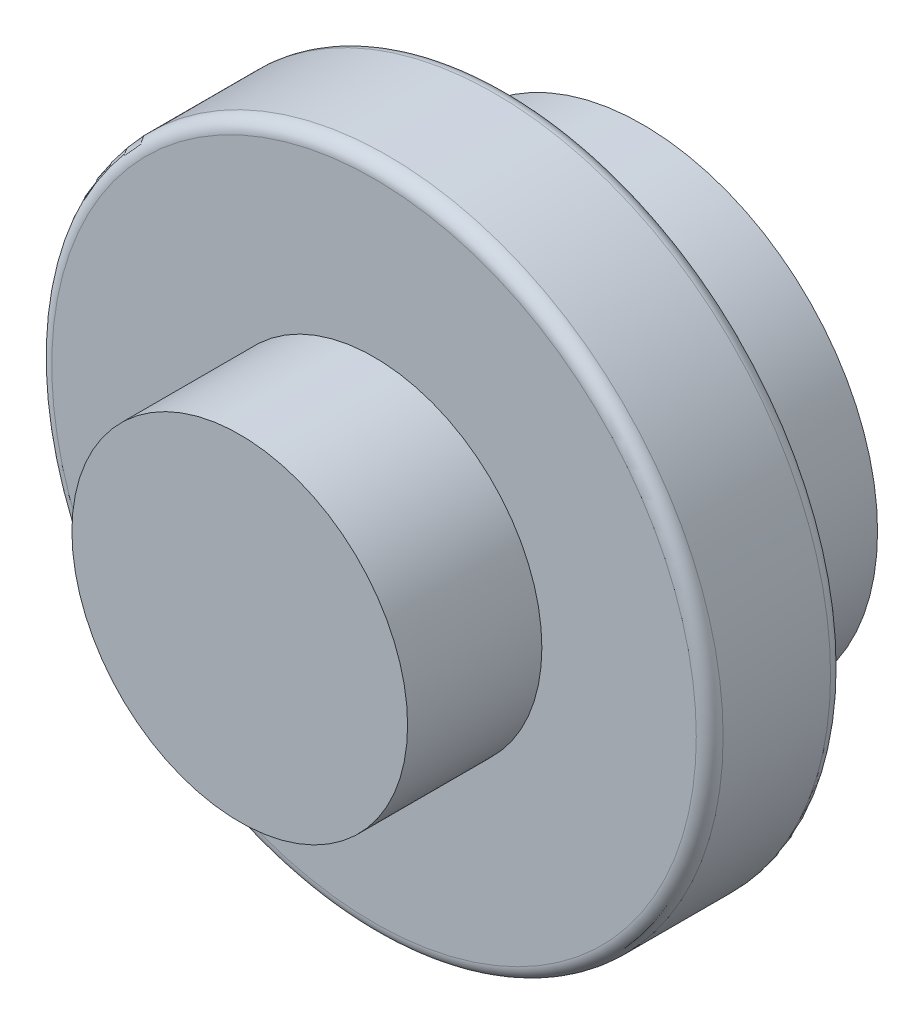
ISO-10303-21;
HEADER;
FILE_DESCRIPTION(('STEP AP214'),'2;1');
FILE_NAME('part.step','',(''),(''),'','','');
FILE_SCHEMA(('AUTOMOTIVE_DESIGN { 1 0 10303 214 1 1 1 1 }'));
ENDSEC;
DATA;
#1=APPLICATION_CONTEXT('core data for automotive mechanical design processes');
#2=APPLICATION_PROTOCOL_DEFINITION('international standard','automotive_design',2000,#1);
#3=PRODUCT_CONTEXT('',#1,'mechanical');
#4=PRODUCT('Part','Part','',(#3));
#5=PRODUCT_RELATED_PRODUCT_CATEGORY('part','',(#4));
#6=PRODUCT_DEFINITION_FORMATION('','',#4);
#7=PRODUCT_DEFINITION_CONTEXT('part definition',#1,'design');
#8=PRODUCT_DEFINITION('design','',#6,#7);
#9=PRODUCT_DEFINITION_SHAPE('','',#8);
#10=(LENGTH_UNIT() NAMED_UNIT(*) SI_UNIT(.MILLI.,.METRE.));
#11=(NAMED_UNIT(*) PLANE_ANGLE_UNIT() SI_UNIT($,.RADIAN.));
#12=(NAMED_UNIT(*) SI_UNIT($,.STERADIAN.) SOLID_ANGLE_UNIT());
#13=UNCERTAINTY_MEASURE_WITH_UNIT(LENGTH_MEASURE(1.E-05),#10,'distance_accuracy_value','');
#14=(GEOMETRIC_REPRESENTATION_CONTEXT(3) GLOBAL_UNCERTAINTY_ASSIGNED_CONTEXT((#13)) GLOBAL_UNIT_ASSIGNED_CONTEXT((#10,
#11,#12)) REPRESENTATION_CONTEXT('',''));
#15=CARTESIAN_POINT('',(0.,0.,0.));
#16=DIRECTION('',(0.,0.,1.));
#17=DIRECTION('',(1.,0.,0.));
#18=AXIS2_PLACEMENT_3D('',#15,#16,#17);
#19=CARTESIAN_POINT('',(0.,0.,10.));
#20=DIRECTION('',(0.,0.,-1.));
#21=DIRECTION('',(-1.,0.,0.));
#22=AXIS2_PLACEMENT_3D('',#19,#20,#21);
#23=CYLINDRICAL_SURFACE('',#22,17.5);
#24=CARTESIAN_POINT('',(0.,0.,10.));
#25=DIRECTION('',(0.,0.,1.));
#26=DIRECTION('',(1.,0.,0.));
#27=AXIS2_PLACEMENT_3D('',#24,#25,#26);
#28=CIRCLE('',#27,17.5);
#29=CARTESIAN_POINT('',(17.5,0.,10.));
#30=VERTEX_POINT('',#29);
#31=EDGE_CURVE('E66',#30,#30,#28,.T.);
#32=ORIENTED_EDGE('',*,*,#31,.F.);
#33=EDGE_LOOP('',(#32));
#34=FACE_BOUND('',#33,.T.);
#35=CARTESIAN_POINT('',(0.,0.,0.));
#36=DIRECTION('',(0.,0.,1.));
#37=DIRECTION('',(1.,0.,0.));
#38=AXIS2_PLACEMENT_3D('',#35,#36,#37);
#39=CIRCLE('',#38,17.5);
#40=CARTESIAN_POINT('',(17.5,0.,0.));
#41=VERTEX_POINT('',#40);
#42=EDGE_CURVE('E62',#41,#41,#39,.T.);
#43=ORIENTED_EDGE('',*,*,#42,.T.);
#44=EDGE_LOOP('',(#43));
#45=FACE_BOUND('',#44,.T.);
#46=ADVANCED_FACE('F37',(#34,#45),#23,.T.);
#47=CARTESIAN_POINT('',(0.,0.,0.));
#48=DIRECTION('',(0.,0.,1.));
#49=DIRECTION('',(1.,0.,0.));
#50=AXIS2_PLACEMENT_3D('',#47,#48,#49);
#51=PLANE('',#50);
#52=ORIENTED_EDGE('',*,*,#42,.F.);
#53=EDGE_LOOP('',(#52));
#54=FACE_BOUND('',#53,.T.);
#55=ADVANCED_FACE('F96',(#54),#51,.F.);
#56=CARTESIAN_POINT('',(0.,0.,20.));
#57=DIRECTION('',(0.,0.,-1.));
#58=DIRECTION('',(-1.,0.,0.));
#59=AXIS2_PLACEMENT_3D('',#56,#57,#58);
#60=CYLINDRICAL_SURFACE('',#59,25.);
#61=CARTESIAN_POINT('',(0.,0.,11.));
#62=DIRECTION('',(0.,0.,1.));
#63=DIRECTION('',(1.,0.,0.));
#64=AXIS2_PLACEMENT_3D('',#61,#62,#63);
#65=CIRCLE('',#64,25.);
#66=CARTESIAN_POINT('',(25.,0.,11.));
#67=VERTEX_POINT('',#66);
#68=EDGE_CURVE('E50',#67,#67,#65,.T.);
#69=ORIENTED_EDGE('',*,*,#68,.T.);
#70=EDGE_LOOP('',(#69));
#71=FACE_BOUND('',#70,.T.);
#72=CARTESIAN_POINT('',(0.,0.,19.));
#73=DIRECTION('',(0.,0.,1.));
#74=DIRECTION('',(1.,0.,0.));
#75=AXIS2_PLACEMENT_3D('',#72,#73,#74);
#76=CIRCLE('',#75,25.);
#77=CARTESIAN_POINT('',(25.,0.,19.));
#78=VERTEX_POINT('',#77);
#79=EDGE_CURVE('E55',#78,#78,#76,.F.);
#80=ORIENTED_EDGE('',*,*,#79,.T.);
#81=EDGE_LOOP('',(#80));
#82=FACE_BOUND('',#81,.T.);
#83=ADVANCED_FACE('F89',(#71,#82),#60,.T.);
#84=CARTESIAN_POINT('',(0.,0.,20.));
#85=DIRECTION('',(0.,0.,1.));
#86=DIRECTION('',(1.,0.,0.));
#87=AXIS2_PLACEMENT_3D('',#84,#85,#86);
#88=PLANE('',#87);
#89=CARTESIAN_POINT('',(0.,0.,20.));
#90=DIRECTION('',(0.,0.,1.));
#91=DIRECTION('',(1.,0.,0.));
#92=AXIS2_PLACEMENT_3D('',#89,#90,#91);
#93=CIRCLE('',#92,24.);
#94=CARTESIAN_POINT('',(24.,0.,20.));
#95=VERTEX_POINT('',#94);
#96=EDGE_CURVE('E10',#95,#95,#93,.T.);
#97=ORIENTED_EDGE('',*,*,#96,.T.);
#98=EDGE_LOOP('',(#97));
#99=FACE_BOUND('',#98,.T.);
#100=CARTESIAN_POINT('',(0.,0.,20.));
#101=DIRECTION('',(0.,0.,1.));
#102=DIRECTION('',(1.,0.,0.));
#103=AXIS2_PLACEMENT_3D('',#100,#101,#102);
#104=CIRCLE('',#103,12.5);
#105=CARTESIAN_POINT('',(12.5,0.,20.));
#106=VERTEX_POINT('',#105);
#107=EDGE_CURVE('E61',#106,#106,#104,.T.);
#108=ORIENTED_EDGE('',*,*,#107,.F.);
#109=EDGE_LOOP('',(#108));
#110=FACE_BOUND('',#109,.T.);
#111=ADVANCED_FACE('F87',(#99,#110),#88,.T.);
#112=CARTESIAN_POINT('',(0.,0.,10.));
#113=DIRECTION('',(0.,0.,1.));
#114=DIRECTION('',(1.,0.,0.));
#115=AXIS2_PLACEMENT_3D('',#112,#113,#114);
#116=PLANE('',#115);
#117=CARTESIAN_POINT('',(0.,0.,10.));
#118=DIRECTION('',(0.,0.,1.));
#119=DIRECTION('',(1.,0.,0.));
#120=AXIS2_PLACEMENT_3D('',#117,#118,#119);
#121=CIRCLE('',#120,24.);
#122=CARTESIAN_POINT('',(24.,0.,10.));
#123=VERTEX_POINT('',#122);
#124=EDGE_CURVE('E45',#123,#123,#121,.F.);
#125=ORIENTED_EDGE('',*,*,#124,.T.);
#126=EDGE_LOOP('',(#125));
#127=FACE_BOUND('',#126,.T.);
#128=ORIENTED_EDGE('',*,*,#31,.T.);
#129=EDGE_LOOP('',(#128));
#130=FACE_BOUND('',#129,.T.);
#131=ADVANCED_FACE('F83',(#127,#130),#116,.F.);
#132=CARTESIAN_POINT('',(0.,0.,30.));
#133=DIRECTION('',(0.,0.,-1.));
#134=DIRECTION('',(-1.,0.,0.));
#135=AXIS2_PLACEMENT_3D('',#132,#133,#134);
#136=CYLINDRICAL_SURFACE('',#135,12.5);
#137=CARTESIAN_POINT('',(0.,0.,30.));
#138=DIRECTION('',(0.,0.,1.));
#139=DIRECTION('',(1.,0.,0.));
#140=AXIS2_PLACEMENT_3D('',#137,#138,#139);
#141=CIRCLE('',#140,12.5);
#142=CARTESIAN_POINT('',(12.5,0.,30.));
#143=VERTEX_POINT('',#142);
#144=EDGE_CURVE('E67',#143,#143,#141,.T.);
#145=ORIENTED_EDGE('',*,*,#144,.F.);
#146=EDGE_LOOP('',(#145));
#147=FACE_BOUND('',#146,.T.);
#148=ORIENTED_EDGE('',*,*,#107,.T.);
#149=EDGE_LOOP('',(#148));
#150=FACE_BOUND('',#149,.T.);
#151=ADVANCED_FACE('F80',(#147,#150),#136,.T.);
#152=CARTESIAN_POINT('',(0.,0.,30.));
#153=DIRECTION('',(0.,0.,1.));
#154=DIRECTION('',(1.,0.,0.));
#155=AXIS2_PLACEMENT_3D('',#152,#153,#154);
#156=PLANE('',#155);
#157=ORIENTED_EDGE('',*,*,#144,.T.);
#158=EDGE_LOOP('',(#157));
#159=FACE_BOUND('',#158,.T.);
#160=ADVANCED_FACE('F78',(#159),#156,.T.);
#161=CARTESIAN_POINT('',(0.,0.,11.));
#162=DIRECTION('',(0.,0.,1.));
#163=DIRECTION('',(1.,0.,0.));
#164=AXIS2_PLACEMENT_3D('',#161,#162,#163);
#165=TOROIDAL_SURFACE('',#164,24.,1.);
#166=ORIENTED_EDGE('',*,*,#124,.F.);
#167=EDGE_LOOP('',(#166));
#168=FACE_BOUND('',#167,.T.);
#169=ORIENTED_EDGE('',*,*,#68,.F.);
#170=EDGE_LOOP('',(#169));
#171=FACE_BOUND('',#170,.T.);
#172=ADVANCED_FACE('F109',(#168,#171),#165,.T.);
#173=CARTESIAN_POINT('',(0.,0.,19.));
#174=DIRECTION('',(0.,0.,1.));
#175=DIRECTION('',(1.,0.,0.));
#176=AXIS2_PLACEMENT_3D('',#173,#174,#175);
#177=TOROIDAL_SURFACE('',#176,24.,1.);
#178=ORIENTED_EDGE('',*,*,#79,.F.);
#179=EDGE_LOOP('',(#178));
#180=FACE_BOUND('',#179,.T.);
#181=ORIENTED_EDGE('',*,*,#96,.F.);
#182=EDGE_LOOP('',(#181));
#183=FACE_BOUND('',#182,.T.);
#184=ADVANCED_FACE('F39',(#180,#183),#177,.T.);
#185=CLOSED_SHELL('',(#46,#55,#83,#111,#131,#151,#160,#172,#184));
#186=MANIFOLD_SOLID_BREP('B2',#185);
#187=ADVANCED_BREP_SHAPE_REPRESENTATION('',(#18,#186),#14);
#188=SHAPE_DEFINITION_REPRESENTATION(#9,#187);
ENDSEC;
END-ISO-10303-21;
